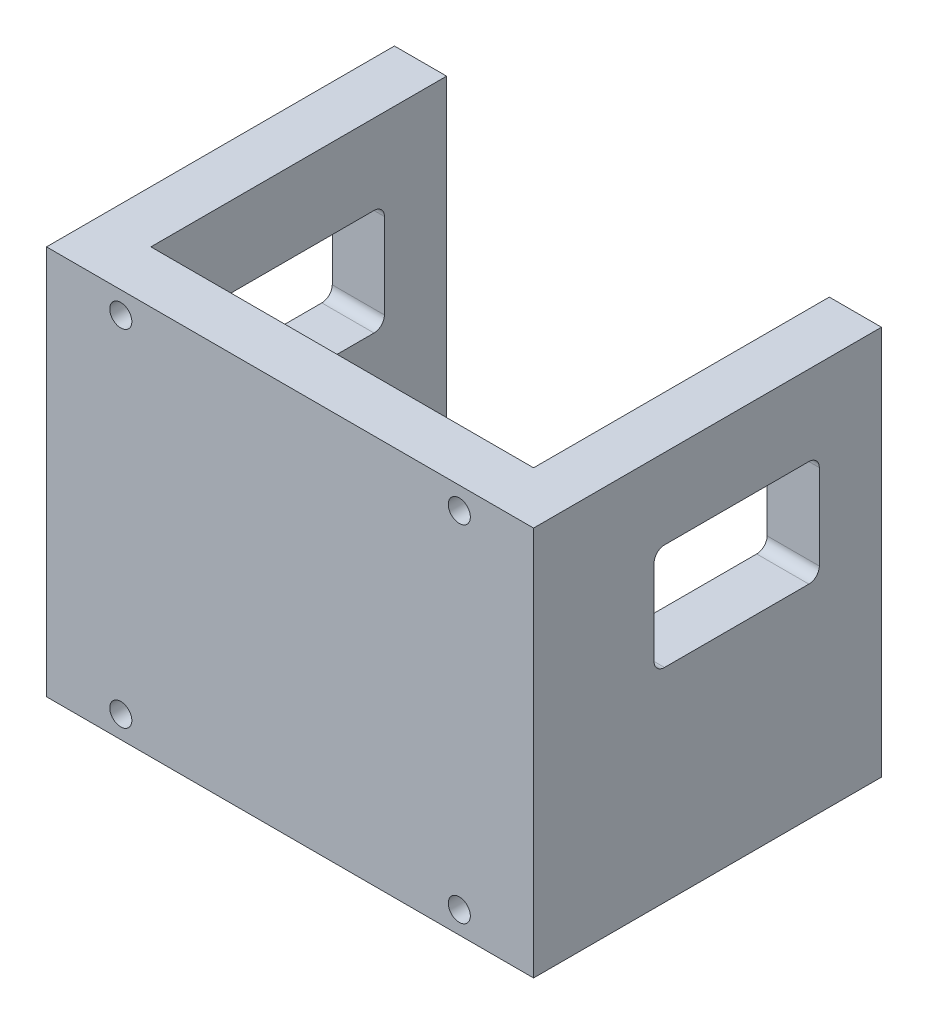
ISO-10303-21;
HEADER;
FILE_DESCRIPTION(('STEP AP214'),'2;1');
FILE_NAME('part.step','',(''),(''),'','','');
FILE_SCHEMA(('AUTOMOTIVE_DESIGN { 1 0 10303 214 1 1 1 1 }'));
ENDSEC;
DATA;
#1=APPLICATION_CONTEXT('core data for automotive mechanical design processes');
#2=APPLICATION_PROTOCOL_DEFINITION('international standard','automotive_design',2000,#1);
#3=PRODUCT_CONTEXT('',#1,'mechanical');
#4=PRODUCT('Part','Part','',(#3));
#5=PRODUCT_RELATED_PRODUCT_CATEGORY('part','',(#4));
#6=PRODUCT_DEFINITION_FORMATION('','',#4);
#7=PRODUCT_DEFINITION_CONTEXT('part definition',#1,'design');
#8=PRODUCT_DEFINITION('design','',#6,#7);
#9=PRODUCT_DEFINITION_SHAPE('','',#8);
#10=(LENGTH_UNIT() NAMED_UNIT(*) SI_UNIT(.MILLI.,.METRE.));
#11=(NAMED_UNIT(*) PLANE_ANGLE_UNIT() SI_UNIT($,.RADIAN.));
#12=(NAMED_UNIT(*) SI_UNIT($,.STERADIAN.) SOLID_ANGLE_UNIT());
#13=UNCERTAINTY_MEASURE_WITH_UNIT(LENGTH_MEASURE(1.E-05),#10,'distance_accuracy_value','');
#14=(GEOMETRIC_REPRESENTATION_CONTEXT(3) GLOBAL_UNCERTAINTY_ASSIGNED_CONTEXT((#13)) GLOBAL_UNIT_ASSIGNED_CONTEXT((#10,
#11,#12)) REPRESENTATION_CONTEXT('',''));
#15=CARTESIAN_POINT('',(0.,0.,0.));
#16=DIRECTION('',(0.,0.,1.));
#17=DIRECTION('',(1.,0.,0.));
#18=AXIS2_PLACEMENT_3D('',#15,#16,#17);
#19=CARTESIAN_POINT('',(0.,0.,0.));
#20=DIRECTION('',(0.,0.,1.));
#21=DIRECTION('',(1.,0.,0.));
#22=AXIS2_PLACEMENT_3D('',#19,#20,#21);
#23=PLANE('',#22);
#24=DIRECTION('',(0.,1.,0.));
#25=VECTOR('',#24,1.);
#26=CARTESIAN_POINT('',(15.4703686201804,-107.586067687366,0.));
#27=LINE('',#26,#25);
#28=CARTESIAN_POINT('',(15.4703686201804,-107.586067687366,0.));
#29=VERTEX_POINT('',#28);
#30=CARTESIAN_POINT('',(15.4703686201804,4.41393231263375,0.));
#31=VERTEX_POINT('',#30);
#32=EDGE_CURVE('E248',#29,#31,#27,.T.);
#33=ORIENTED_EDGE('',*,*,#32,.T.);
#34=DIRECTION('',(-1.,0.,0.));
#35=VECTOR('',#34,1.);
#36=CARTESIAN_POINT('',(-109.52963137982,4.41393231263375,0.));
#37=LINE('',#36,#35);
#38=CARTESIAN_POINT('',(30.4703686201804,4.41393231263375,0.));
#39=VERTEX_POINT('',#38);
#40=EDGE_CURVE('E259',#39,#31,#37,.T.);
#41=ORIENTED_EDGE('',*,*,#40,.F.);
#42=DIRECTION('',(0.,1.,0.));
#43=VECTOR('',#42,1.);
#44=CARTESIAN_POINT('',(30.4703686201804,-107.586067687366,0.));
#45=LINE('',#44,#43);
#46=CARTESIAN_POINT('',(30.4703686201804,-107.586067687366,0.));
#47=VERTEX_POINT('',#46);
#48=EDGE_CURVE('E275',#47,#39,#45,.T.);
#49=ORIENTED_EDGE('',*,*,#48,.F.);
#50=DIRECTION('',(1.,0.,0.));
#51=VECTOR('',#50,1.);
#52=CARTESIAN_POINT('',(-109.52963137982,-107.586067687366,0.));
#53=LINE('',#52,#51);
#54=EDGE_CURVE('E272',#29,#47,#53,.T.);
#55=ORIENTED_EDGE('',*,*,#54,.F.);
#56=EDGE_LOOP('',(#33,#41,#49,#55));
#57=FACE_BOUND('',#56,.T.);
#58=ADVANCED_FACE('F39',(#57),#23,.F.);
#59=CARTESIAN_POINT('',(-109.52963137982,4.41393231263375,100.));
#60=DIRECTION('',(1.,0.,0.));
#61=DIRECTION('',(0.,1.,0.));
#62=AXIS2_PLACEMENT_3D('',#59,#60,#61);
#63=PLANE('',#62);
#64=DIRECTION('',(0.,0.,1.));
#65=VECTOR('',#64,1.);
#66=CARTESIAN_POINT('',(-109.52963137982,-49.098204430468,17.8675184167871));
#67=LINE('',#66,#65);
#68=CARTESIAN_POINT('',(-109.52963137982,-49.098204430468,20.8675184167871));
#69=VERTEX_POINT('',#68);
#70=CARTESIAN_POINT('',(-109.52963137982,-49.098204430468,62.3675184167871));
#71=VERTEX_POINT('',#70);
#72=EDGE_CURVE('E450',#69,#71,#67,.T.);
#73=ORIENTED_EDGE('',*,*,#72,.F.);
#74=CARTESIAN_POINT('',(-109.52963137982,-46.098204430468,20.8675184167871));
#75=DIRECTION('',(1.,0.,0.));
#76=DIRECTION('',(0.,1.,0.));
#77=AXIS2_PLACEMENT_3D('',#74,#75,#76);
#78=CIRCLE('',#77,3.);
#79=CARTESIAN_POINT('',(-109.52963137982,-46.098204430468,17.8675184167871));
#80=VERTEX_POINT('',#79);
#81=EDGE_CURVE('E378',#69,#80,#78,.T.);
#82=ORIENTED_EDGE('',*,*,#81,.T.);
#83=DIRECTION('',(0.,-1.,0.));
#84=VECTOR('',#83,1.);
#85=CARTESIAN_POINT('',(-109.52963137982,-49.098204430468,17.8675184167871));
#86=LINE('',#85,#84);
#87=CARTESIAN_POINT('',(-109.52963137982,-21.598204430468,17.8675184167871));
#88=VERTEX_POINT('',#87);
#89=EDGE_CURVE('E446',#88,#80,#86,.T.);
#90=ORIENTED_EDGE('',*,*,#89,.F.);
#91=CARTESIAN_POINT('',(-109.52963137982,-21.598204430468,20.8675184167871));
#92=DIRECTION('',(1.,0.,0.));
#93=DIRECTION('',(0.,1.,0.));
#94=AXIS2_PLACEMENT_3D('',#91,#92,#93);
#95=CIRCLE('',#94,3.);
#96=CARTESIAN_POINT('',(-109.52963137982,-18.598204430468,20.8675184167871));
#97=VERTEX_POINT('',#96);
#98=EDGE_CURVE('E372',#88,#97,#95,.T.);
#99=ORIENTED_EDGE('',*,*,#98,.T.);
#100=DIRECTION('',(0.,0.,-1.));
#101=VECTOR('',#100,1.);
#102=CARTESIAN_POINT('',(-109.52963137982,-18.598204430468,17.8675184167871));
#103=LINE('',#102,#101);
#104=CARTESIAN_POINT('',(-109.52963137982,-18.598204430468,62.3675184167871));
#105=VERTEX_POINT('',#104);
#106=EDGE_CURVE('E425',#105,#97,#103,.T.);
#107=ORIENTED_EDGE('',*,*,#106,.F.);
#108=CARTESIAN_POINT('',(-109.52963137982,-21.598204430468,62.3675184167871));
#109=DIRECTION('',(1.,0.,0.));
#110=DIRECTION('',(0.,1.,0.));
#111=AXIS2_PLACEMENT_3D('',#108,#109,#110);
#112=CIRCLE('',#111,3.);
#113=CARTESIAN_POINT('',(-109.52963137982,-21.598204430468,65.3675184167871));
#114=VERTEX_POINT('',#113);
#115=EDGE_CURVE('E366',#105,#114,#112,.T.);
#116=ORIENTED_EDGE('',*,*,#115,.T.);
#117=DIRECTION('',(0.,1.,0.));
#118=VECTOR('',#117,1.);
#119=CARTESIAN_POINT('',(-109.52963137982,-49.098204430468,65.3675184167871));
#120=LINE('',#119,#118);
#121=CARTESIAN_POINT('',(-109.52963137982,-46.098204430468,65.3675184167871));
#122=VERTEX_POINT('',#121);
#123=EDGE_CURVE('E433',#122,#114,#120,.T.);
#124=ORIENTED_EDGE('',*,*,#123,.F.);
#125=CARTESIAN_POINT('',(-109.52963137982,-46.098204430468,62.3675184167871));
#126=DIRECTION('',(1.,0.,0.));
#127=DIRECTION('',(0.,1.,0.));
#128=AXIS2_PLACEMENT_3D('',#125,#126,#127);
#129=CIRCLE('',#128,3.);
#130=EDGE_CURVE('E384',#122,#71,#129,.T.);
#131=ORIENTED_EDGE('',*,*,#130,.T.);
#132=EDGE_LOOP('',(#73,#82,#90,#99,#107,#116,#124,#131));
#133=FACE_BOUND('',#132,.T.);
#134=DIRECTION('',(0.,-1.,0.));
#135=VECTOR('',#134,1.);
#136=CARTESIAN_POINT('',(-109.52963137982,4.41393231263375,0.));
#137=LINE('',#136,#135);
#138=CARTESIAN_POINT('',(-109.52963137982,4.41393231263375,0.));
#139=VERTEX_POINT('',#138);
#140=CARTESIAN_POINT('',(-109.52963137982,-107.586067687366,0.));
#141=VERTEX_POINT('',#140);
#142=EDGE_CURVE('E247',#139,#141,#137,.T.);
#143=ORIENTED_EDGE('',*,*,#142,.T.);
#144=DIRECTION('',(0.,0.,-1.));
#145=VECTOR('',#144,1.);
#146=CARTESIAN_POINT('',(-109.52963137982,-107.586067687366,100.));
#147=LINE('',#146,#145);
#148=CARTESIAN_POINT('',(-109.52963137982,-107.586067687366,100.));
#149=VERTEX_POINT('',#148);
#150=EDGE_CURVE('E293',#149,#141,#147,.T.);
#151=ORIENTED_EDGE('',*,*,#150,.F.);
#152=DIRECTION('',(0.,-1.,0.));
#153=VECTOR('',#152,1.);
#154=CARTESIAN_POINT('',(-109.52963137982,4.41393231263375,100.));
#155=LINE('',#154,#153);
#156=CARTESIAN_POINT('',(-109.52963137982,4.41393231263375,100.));
#157=VERTEX_POINT('',#156);
#158=EDGE_CURVE('E254',#157,#149,#155,.T.);
#159=ORIENTED_EDGE('',*,*,#158,.F.);
#160=DIRECTION('',(0.,0.,-1.));
#161=VECTOR('',#160,1.);
#162=CARTESIAN_POINT('',(-109.52963137982,4.41393231263375,100.));
#163=LINE('',#162,#161);
#164=EDGE_CURVE('E268',#157,#139,#163,.T.);
#165=ORIENTED_EDGE('',*,*,#164,.T.);
#166=EDGE_LOOP('',(#143,#151,#159,#165));
#167=FACE_BOUND('',#166,.T.);
#168=ADVANCED_FACE('F486',(#133,#167),#63,.F.);
#169=CARTESIAN_POINT('',(-109.52963137982,-107.586067687366,100.));
#170=DIRECTION('',(0.,1.,0.));
#171=DIRECTION('',(0.,0.,1.));
#172=AXIS2_PLACEMENT_3D('',#169,#170,#171);
#173=PLANE('',#172);
#174=CARTESIAN_POINT('',(-94.5296313798196,-107.586067687366,0.));
#175=VERTEX_POINT('',#174);
#176=EDGE_CURVE('E226',#141,#175,#53,.T.);
#177=ORIENTED_EDGE('',*,*,#176,.T.);
#178=DIRECTION('',(0.,0.,1.));
#179=VECTOR('',#178,1.);
#180=CARTESIAN_POINT('',(-94.5296313798196,-107.586067687366,0.));
#181=LINE('',#180,#179);
#182=CARTESIAN_POINT('',(-94.5296313798196,-107.586067687366,85.));
#183=VERTEX_POINT('',#182);
#184=EDGE_CURVE('E204',#175,#183,#181,.T.);
#185=ORIENTED_EDGE('',*,*,#184,.T.);
#186=DIRECTION('',(1.,0.,0.));
#187=VECTOR('',#186,1.);
#188=CARTESIAN_POINT('',(-94.5296313798196,-107.586067687366,85.));
#189=LINE('',#188,#187);
#190=CARTESIAN_POINT('',(15.4703686201804,-107.586067687366,85.));
#191=VERTEX_POINT('',#190);
#192=EDGE_CURVE('E217',#183,#191,#189,.T.);
#193=ORIENTED_EDGE('',*,*,#192,.T.);
#194=DIRECTION('',(0.,0.,1.));
#195=VECTOR('',#194,1.);
#196=CARTESIAN_POINT('',(15.4703686201804,-107.586067687366,0.));
#197=LINE('',#196,#195);
#198=EDGE_CURVE('E213',#29,#191,#197,.T.);
#199=ORIENTED_EDGE('',*,*,#198,.F.);
#200=ORIENTED_EDGE('',*,*,#54,.T.);
#201=DIRECTION('',(0.,0.,-1.));
#202=VECTOR('',#201,1.);
#203=CARTESIAN_POINT('',(30.4703686201804,-107.586067687366,100.));
#204=LINE('',#203,#202);
#205=CARTESIAN_POINT('',(30.4703686201804,-107.586067687366,100.));
#206=VERTEX_POINT('',#205);
#207=EDGE_CURVE('E289',#206,#47,#204,.T.);
#208=ORIENTED_EDGE('',*,*,#207,.F.);
#209=DIRECTION('',(1.,0.,0.));
#210=VECTOR('',#209,1.);
#211=CARTESIAN_POINT('',(-109.52963137982,-107.586067687366,100.));
#212=LINE('',#211,#210);
#213=EDGE_CURVE('E258',#149,#206,#212,.T.);
#214=ORIENTED_EDGE('',*,*,#213,.F.);
#215=ORIENTED_EDGE('',*,*,#150,.T.);
#216=EDGE_LOOP('',(#177,#185,#193,#199,#200,#208,#214,#215));
#217=FACE_BOUND('',#216,.T.);
#218=ADVANCED_FACE('F224',(#217),#173,.F.);
#219=CARTESIAN_POINT('',(30.4703686201804,-107.586067687366,100.));
#220=DIRECTION('',(-1.,0.,0.));
#221=DIRECTION('',(0.,0.,1.));
#222=AXIS2_PLACEMENT_3D('',#219,#220,#221);
#223=PLANE('',#222);
#224=DIRECTION('',(0.,1.,0.));
#225=VECTOR('',#224,1.);
#226=CARTESIAN_POINT('',(30.4703686201804,-49.098204430468,65.3675184167871));
#227=LINE('',#226,#225);
#228=CARTESIAN_POINT('',(30.4703686201804,-46.098204430468,65.3675184167871));
#229=VERTEX_POINT('',#228);
#230=CARTESIAN_POINT('',(30.4703686201804,-21.598204430468,65.3675184167871));
#231=VERTEX_POINT('',#230);
#232=EDGE_CURVE('E430',#229,#231,#227,.T.);
#233=ORIENTED_EDGE('',*,*,#232,.T.);
#234=CARTESIAN_POINT('',(30.4703686201804,-21.598204430468,62.3675184167871));
#235=DIRECTION('',(-1.,0.,0.));
#236=DIRECTION('',(0.,0.,1.));
#237=AXIS2_PLACEMENT_3D('',#234,#235,#236);
#238=CIRCLE('',#237,3.);
#239=CARTESIAN_POINT('',(30.4703686201804,-18.598204430468,62.3675184167871));
#240=VERTEX_POINT('',#239);
#241=EDGE_CURVE('E399',#231,#240,#238,.T.);
#242=ORIENTED_EDGE('',*,*,#241,.T.);
#243=DIRECTION('',(0.,0.,-1.));
#244=VECTOR('',#243,1.);
#245=CARTESIAN_POINT('',(30.4703686201804,-18.598204430468,17.8675184167871));
#246=LINE('',#245,#244);
#247=CARTESIAN_POINT('',(30.4703686201804,-18.598204430468,20.8675184167871));
#248=VERTEX_POINT('',#247);
#249=EDGE_CURVE('E442',#240,#248,#246,.T.);
#250=ORIENTED_EDGE('',*,*,#249,.T.);
#251=CARTESIAN_POINT('',(30.4703686201804,-21.598204430468,20.8675184167871));
#252=DIRECTION('',(-1.,0.,0.));
#253=DIRECTION('',(0.,0.,1.));
#254=AXIS2_PLACEMENT_3D('',#251,#252,#253);
#255=CIRCLE('',#254,3.);
#256=CARTESIAN_POINT('',(30.4703686201804,-21.598204430468,17.8675184167871));
#257=VERTEX_POINT('',#256);
#258=EDGE_CURVE('E11',#248,#257,#255,.T.);
#259=ORIENTED_EDGE('',*,*,#258,.T.);
#260=DIRECTION('',(0.,-1.,0.));
#261=VECTOR('',#260,1.);
#262=CARTESIAN_POINT('',(30.4703686201804,-49.098204430468,17.8675184167871));
#263=LINE('',#262,#261);
#264=CARTESIAN_POINT('',(30.4703686201804,-46.098204430468,17.8675184167871));
#265=VERTEX_POINT('',#264);
#266=EDGE_CURVE('E421',#257,#265,#263,.T.);
#267=ORIENTED_EDGE('',*,*,#266,.T.);
#268=CARTESIAN_POINT('',(30.4703686201804,-46.098204430468,20.8675184167871));
#269=DIRECTION('',(-1.,0.,0.));
#270=DIRECTION('',(0.,0.,1.));
#271=AXIS2_PLACEMENT_3D('',#268,#269,#270);
#272=CIRCLE('',#271,3.);
#273=CARTESIAN_POINT('',(30.4703686201804,-49.098204430468,20.8675184167871));
#274=VERTEX_POINT('',#273);
#275=EDGE_CURVE('E405',#265,#274,#272,.T.);
#276=ORIENTED_EDGE('',*,*,#275,.T.);
#277=DIRECTION('',(0.,0.,1.));
#278=VECTOR('',#277,1.);
#279=CARTESIAN_POINT('',(30.4703686201804,-49.098204430468,17.8675184167871));
#280=LINE('',#279,#278);
#281=CARTESIAN_POINT('',(30.4703686201804,-49.098204430468,62.3675184167871));
#282=VERTEX_POINT('',#281);
#283=EDGE_CURVE('E424',#274,#282,#280,.T.);
#284=ORIENTED_EDGE('',*,*,#283,.T.);
#285=CARTESIAN_POINT('',(30.4703686201804,-46.098204430468,62.3675184167871));
#286=DIRECTION('',(-1.,0.,0.));
#287=DIRECTION('',(0.,0.,1.));
#288=AXIS2_PLACEMENT_3D('',#285,#286,#287);
#289=CIRCLE('',#288,3.);
#290=EDGE_CURVE('E393',#282,#229,#289,.T.);
#291=ORIENTED_EDGE('',*,*,#290,.T.);
#292=EDGE_LOOP('',(#233,#242,#250,#259,#267,#276,#284,#291));
#293=FACE_BOUND('',#292,.T.);
#294=ORIENTED_EDGE('',*,*,#48,.T.);
#295=DIRECTION('',(0.,0.,-1.));
#296=VECTOR('',#295,1.);
#297=CARTESIAN_POINT('',(30.4703686201804,4.41393231263375,100.));
#298=LINE('',#297,#296);
#299=CARTESIAN_POINT('',(30.4703686201804,4.41393231263375,100.));
#300=VERTEX_POINT('',#299);
#301=EDGE_CURVE('E285',#300,#39,#298,.T.);
#302=ORIENTED_EDGE('',*,*,#301,.F.);
#303=DIRECTION('',(0.,1.,0.));
#304=VECTOR('',#303,1.);
#305=CARTESIAN_POINT('',(30.4703686201804,-107.586067687366,100.));
#306=LINE('',#305,#304);
#307=EDGE_CURVE('E262',#206,#300,#306,.T.);
#308=ORIENTED_EDGE('',*,*,#307,.F.);
#309=ORIENTED_EDGE('',*,*,#207,.T.);
#310=EDGE_LOOP('',(#294,#302,#308,#309));
#311=FACE_BOUND('',#310,.T.);
#312=ADVANCED_FACE('F549',(#293,#311),#223,.F.);
#313=CARTESIAN_POINT('',(-109.52963137982,4.41393231263375,100.));
#314=DIRECTION('',(0.,-1.,0.));
#315=DIRECTION('',(0.,0.,-1.));
#316=AXIS2_PLACEMENT_3D('',#313,#314,#315);
#317=PLANE('',#316);
#318=DIRECTION('',(1.,0.,0.));
#319=VECTOR('',#318,1.);
#320=CARTESIAN_POINT('',(-94.5296313798196,4.41393231263375,85.));
#321=LINE('',#320,#319);
#322=CARTESIAN_POINT('',(-94.5296313798196,4.41393231263375,85.));
#323=VERTEX_POINT('',#322);
#324=CARTESIAN_POINT('',(15.4703686201804,4.41393231263375,85.));
#325=VERTEX_POINT('',#324);
#326=EDGE_CURVE('E232',#323,#325,#321,.T.);
#327=ORIENTED_EDGE('',*,*,#326,.F.);
#328=DIRECTION('',(0.,0.,1.));
#329=VECTOR('',#328,1.);
#330=CARTESIAN_POINT('',(-94.5296313798196,4.41393231263375,0.));
#331=LINE('',#330,#329);
#332=CARTESIAN_POINT('',(-94.5296313798196,4.41393231263375,0.));
#333=VERTEX_POINT('',#332);
#334=EDGE_CURVE('E207',#333,#323,#331,.T.);
#335=ORIENTED_EDGE('',*,*,#334,.F.);
#336=EDGE_CURVE('E278',#333,#139,#37,.T.);
#337=ORIENTED_EDGE('',*,*,#336,.T.);
#338=ORIENTED_EDGE('',*,*,#164,.F.);
#339=DIRECTION('',(-1.,0.,0.));
#340=VECTOR('',#339,1.);
#341=CARTESIAN_POINT('',(-109.52963137982,4.41393231263375,100.));
#342=LINE('',#341,#340);
#343=EDGE_CURVE('E265',#300,#157,#342,.T.);
#344=ORIENTED_EDGE('',*,*,#343,.F.);
#345=ORIENTED_EDGE('',*,*,#301,.T.);
#346=ORIENTED_EDGE('',*,*,#40,.T.);
#347=DIRECTION('',(0.,0.,1.));
#348=VECTOR('',#347,1.);
#349=CARTESIAN_POINT('',(15.4703686201804,4.41393231263375,0.));
#350=LINE('',#349,#348);
#351=EDGE_CURVE('E228',#31,#325,#350,.T.);
#352=ORIENTED_EDGE('',*,*,#351,.T.);
#353=EDGE_LOOP('',(#327,#335,#337,#338,#344,#345,#346,#352));
#354=FACE_BOUND('',#353,.T.);
#355=ADVANCED_FACE('F536',(#354),#317,.F.);
#356=CARTESIAN_POINT('',(0.,0.,100.));
#357=DIRECTION('',(0.,0.,1.));
#358=DIRECTION('',(1.,0.,0.));
#359=AXIS2_PLACEMENT_3D('',#356,#357,#358);
#360=PLANE('',#359);
#361=CARTESIAN_POINT('',(-88.1796313798196,-101.236067687366,100.));
#362=DIRECTION('',(0.,0.,-1.));
#363=DIRECTION('',(1.,0.,0.));
#364=AXIS2_PLACEMENT_3D('',#361,#362,#363);
#365=CIRCLE('',#364,3.175);
#366=CARTESIAN_POINT('',(-85.0046313798196,-101.236067687366,100.));
#367=VERTEX_POINT('',#366);
#368=EDGE_CURVE('E598',#367,#367,#365,.T.);
#369=ORIENTED_EDGE('',*,*,#368,.T.);
#370=EDGE_LOOP('',(#369));
#371=FACE_BOUND('',#370,.T.);
#372=CARTESIAN_POINT('',(9.12036862018041,-101.236067687366,100.));
#373=DIRECTION('',(0.,0.,1.));
#374=DIRECTION('',(-1.,0.,0.));
#375=AXIS2_PLACEMENT_3D('',#372,#373,#374);
#376=CIRCLE('',#375,3.175);
#377=CARTESIAN_POINT('',(5.94536862018041,-101.236067687366,100.));
#378=VERTEX_POINT('',#377);
#379=EDGE_CURVE('E593',#378,#378,#376,.T.);
#380=ORIENTED_EDGE('',*,*,#379,.F.);
#381=EDGE_LOOP('',(#380));
#382=FACE_BOUND('',#381,.T.);
#383=CARTESIAN_POINT('',(-88.1796313798196,-1.93606768736623,100.));
#384=DIRECTION('',(0.,0.,1.));
#385=DIRECTION('',(1.,0.,0.));
#386=AXIS2_PLACEMENT_3D('',#383,#384,#385);
#387=CIRCLE('',#386,3.175);
#388=CARTESIAN_POINT('',(-85.0046313798196,-1.93606768736623,100.));
#389=VERTEX_POINT('',#388);
#390=EDGE_CURVE('E584',#389,#389,#387,.T.);
#391=ORIENTED_EDGE('',*,*,#390,.F.);
#392=EDGE_LOOP('',(#391));
#393=FACE_BOUND('',#392,.T.);
#394=CARTESIAN_POINT('',(9.12036862018041,-1.93606768736625,100.));
#395=DIRECTION('',(0.,0.,-1.));
#396=DIRECTION('',(-1.,0.,0.));
#397=AXIS2_PLACEMENT_3D('',#394,#395,#396);
#398=CIRCLE('',#397,3.175);
#399=CARTESIAN_POINT('',(5.94536862018041,-1.93606768736625,100.));
#400=VERTEX_POINT('',#399);
#401=EDGE_CURVE('E451',#400,#400,#398,.T.);
#402=ORIENTED_EDGE('',*,*,#401,.T.);
#403=EDGE_LOOP('',(#402));
#404=FACE_BOUND('',#403,.T.);
#405=ORIENTED_EDGE('',*,*,#158,.T.);
#406=ORIENTED_EDGE('',*,*,#213,.T.);
#407=ORIENTED_EDGE('',*,*,#307,.T.);
#408=ORIENTED_EDGE('',*,*,#343,.T.);
#409=EDGE_LOOP('',(#405,#406,#407,#408));
#410=FACE_BOUND('',#409,.T.);
#411=ADVANCED_FACE('F529',(#371,#382,#393,#404,#410),#360,.T.);
#412=ORIENTED_EDGE('',*,*,#336,.F.);
#413=DIRECTION('',(0.,1.,0.));
#414=VECTOR('',#413,1.);
#415=CARTESIAN_POINT('',(-94.5296313798196,-107.586067687366,0.));
#416=LINE('',#415,#414);
#417=EDGE_CURVE('E244',#175,#333,#416,.T.);
#418=ORIENTED_EDGE('',*,*,#417,.F.);
#419=ORIENTED_EDGE('',*,*,#176,.F.);
#420=ORIENTED_EDGE('',*,*,#142,.F.);
#421=EDGE_LOOP('',(#412,#418,#419,#420));
#422=FACE_BOUND('',#421,.T.);
#423=ADVANCED_FACE('F521',(#422),#23,.F.);
#424=CARTESIAN_POINT('',(-94.5296313798196,-107.586067687366,0.));
#425=DIRECTION('',(-1.,0.,0.));
#426=DIRECTION('',(0.,0.,1.));
#427=AXIS2_PLACEMENT_3D('',#424,#425,#426);
#428=PLANE('',#427);
#429=DIRECTION('',(0.,1.,0.));
#430=VECTOR('',#429,1.);
#431=CARTESIAN_POINT('',(-94.5296313798196,-107.586067687366,65.3675184167871));
#432=LINE('',#431,#430);
#433=CARTESIAN_POINT('',(-94.5296313798196,-46.098204430468,65.3675184167871));
#434=VERTEX_POINT('',#433);
#435=CARTESIAN_POINT('',(-94.5296313798196,-21.598204430468,65.3675184167871));
#436=VERTEX_POINT('',#435);
#437=EDGE_CURVE('E461',#434,#436,#432,.T.);
#438=ORIENTED_EDGE('',*,*,#437,.T.);
#439=CARTESIAN_POINT('',(-94.5296313798196,-21.598204430468,62.3675184167871));
#440=DIRECTION('',(-1.,0.,0.));
#441=DIRECTION('',(0.,0.,1.));
#442=AXIS2_PLACEMENT_3D('',#439,#440,#441);
#443=CIRCLE('',#442,3.);
#444=CARTESIAN_POINT('',(-94.5296313798196,-18.598204430468,62.3675184167871));
#445=VERTEX_POINT('',#444);
#446=EDGE_CURVE('E369',#436,#445,#443,.T.);
#447=ORIENTED_EDGE('',*,*,#446,.T.);
#448=DIRECTION('',(0.,0.,-1.));
#449=VECTOR('',#448,1.);
#450=CARTESIAN_POINT('',(-94.5296313798196,-18.598204430468,0.));
#451=LINE('',#450,#449);
#452=CARTESIAN_POINT('',(-94.5296313798196,-18.598204430468,20.8675184167871));
#453=VERTEX_POINT('',#452);
#454=EDGE_CURVE('E464',#445,#453,#451,.T.);
#455=ORIENTED_EDGE('',*,*,#454,.T.);
#456=CARTESIAN_POINT('',(-94.5296313798196,-21.598204430468,20.8675184167871));
#457=DIRECTION('',(-1.,0.,0.));
#458=DIRECTION('',(0.,0.,1.));
#459=AXIS2_PLACEMENT_3D('',#456,#457,#458);
#460=CIRCLE('',#459,3.);
#461=CARTESIAN_POINT('',(-94.5296313798196,-21.598204430468,17.8675184167871));
#462=VERTEX_POINT('',#461);
#463=EDGE_CURVE('E375',#453,#462,#460,.T.);
#464=ORIENTED_EDGE('',*,*,#463,.T.);
#465=DIRECTION('',(0.,-1.,0.));
#466=VECTOR('',#465,1.);
#467=CARTESIAN_POINT('',(-94.5296313798196,-107.586067687366,17.8675184167871));
#468=LINE('',#467,#466);
#469=CARTESIAN_POINT('',(-94.5296313798196,-46.098204430468,17.8675184167871));
#470=VERTEX_POINT('',#469);
#471=EDGE_CURVE('E235',#462,#470,#468,.T.);
#472=ORIENTED_EDGE('',*,*,#471,.T.);
#473=CARTESIAN_POINT('',(-94.5296313798196,-46.098204430468,20.8675184167871));
#474=DIRECTION('',(-1.,0.,0.));
#475=DIRECTION('',(0.,0.,1.));
#476=AXIS2_PLACEMENT_3D('',#473,#474,#475);
#477=CIRCLE('',#476,3.);
#478=CARTESIAN_POINT('',(-94.5296313798196,-49.098204430468,20.8675184167871));
#479=VERTEX_POINT('',#478);
#480=EDGE_CURVE('E381',#470,#479,#477,.T.);
#481=ORIENTED_EDGE('',*,*,#480,.T.);
#482=DIRECTION('',(0.,0.,1.));
#483=VECTOR('',#482,1.);
#484=CARTESIAN_POINT('',(-94.5296313798196,-49.098204430468,0.));
#485=LINE('',#484,#483);
#486=CARTESIAN_POINT('',(-94.5296313798196,-49.098204430468,62.3675184167871));
#487=VERTEX_POINT('',#486);
#488=EDGE_CURVE('E445',#479,#487,#485,.T.);
#489=ORIENTED_EDGE('',*,*,#488,.T.);
#490=CARTESIAN_POINT('',(-94.5296313798196,-46.098204430468,62.3675184167871));
#491=DIRECTION('',(-1.,0.,0.));
#492=DIRECTION('',(0.,0.,1.));
#493=AXIS2_PLACEMENT_3D('',#490,#491,#492);
#494=CIRCLE('',#493,3.);
#495=EDGE_CURVE('E387',#487,#434,#494,.T.);
#496=ORIENTED_EDGE('',*,*,#495,.T.);
#497=EDGE_LOOP('',(#438,#447,#455,#464,#472,#481,#489,#496));
#498=FACE_BOUND('',#497,.T.);
#499=ORIENTED_EDGE('',*,*,#334,.T.);
#500=DIRECTION('',(0.,1.,0.));
#501=VECTOR('',#500,1.);
#502=CARTESIAN_POINT('',(-94.5296313798196,-107.586067687366,85.));
#503=LINE('',#502,#501);
#504=EDGE_CURVE('E200',#183,#323,#503,.T.);
#505=ORIENTED_EDGE('',*,*,#504,.F.);
#506=ORIENTED_EDGE('',*,*,#184,.F.);
#507=ORIENTED_EDGE('',*,*,#417,.T.);
#508=EDGE_LOOP('',(#499,#505,#506,#507));
#509=FACE_BOUND('',#508,.T.);
#510=ADVANCED_FACE('F202',(#498,#509),#428,.F.);
#511=CARTESIAN_POINT('',(15.4703686201804,-107.586067687366,0.));
#512=DIRECTION('',(-1.,0.,0.));
#513=DIRECTION('',(0.,0.,1.));
#514=AXIS2_PLACEMENT_3D('',#511,#512,#513);
#515=PLANE('',#514);
#516=DIRECTION('',(0.,-1.,0.));
#517=VECTOR('',#516,1.);
#518=CARTESIAN_POINT('',(15.4703686201804,-107.586067687366,17.8675184167871));
#519=LINE('',#518,#517);
#520=CARTESIAN_POINT('',(15.4703686201804,-21.598204430468,17.8675184167871));
#521=VERTEX_POINT('',#520);
#522=CARTESIAN_POINT('',(15.4703686201804,-46.098204430468,17.8675184167871));
#523=VERTEX_POINT('',#522);
#524=EDGE_CURVE('E308',#521,#523,#519,.T.);
#525=ORIENTED_EDGE('',*,*,#524,.F.);
#526=CARTESIAN_POINT('',(15.4703686201804,-21.598204430468,20.8675184167871));
#527=DIRECTION('',(-1.,0.,0.));
#528=DIRECTION('',(0.,0.,1.));
#529=AXIS2_PLACEMENT_3D('',#526,#527,#528);
#530=CIRCLE('',#529,3.);
#531=CARTESIAN_POINT('',(15.4703686201804,-18.598204430468,20.8675184167871));
#532=VERTEX_POINT('',#531);
#533=EDGE_CURVE('E48',#521,#532,#530,.F.);
#534=ORIENTED_EDGE('',*,*,#533,.T.);
#535=DIRECTION('',(0.,0.,-1.));
#536=VECTOR('',#535,1.);
#537=CARTESIAN_POINT('',(15.4703686201804,-18.598204430468,0.));
#538=LINE('',#537,#536);
#539=CARTESIAN_POINT('',(15.4703686201804,-18.598204430468,62.3675184167871));
#540=VERTEX_POINT('',#539);
#541=EDGE_CURVE('E304',#540,#532,#538,.T.);
#542=ORIENTED_EDGE('',*,*,#541,.F.);
#543=CARTESIAN_POINT('',(15.4703686201804,-21.598204430468,62.3675184167871));
#544=DIRECTION('',(-1.,0.,0.));
#545=DIRECTION('',(0.,0.,1.));
#546=AXIS2_PLACEMENT_3D('',#543,#544,#545);
#547=CIRCLE('',#546,3.);
#548=CARTESIAN_POINT('',(15.4703686201804,-21.598204430468,65.3675184167871));
#549=VERTEX_POINT('',#548);
#550=EDGE_CURVE('E396',#540,#549,#547,.F.);
#551=ORIENTED_EDGE('',*,*,#550,.T.);
#552=DIRECTION('',(0.,1.,0.));
#553=VECTOR('',#552,1.);
#554=CARTESIAN_POINT('',(15.4703686201804,-107.586067687366,65.3675184167871));
#555=LINE('',#554,#553);
#556=CARTESIAN_POINT('',(15.4703686201804,-46.098204430468,65.3675184167871));
#557=VERTEX_POINT('',#556);
#558=EDGE_CURVE('E300',#557,#549,#555,.T.);
#559=ORIENTED_EDGE('',*,*,#558,.F.);
#560=CARTESIAN_POINT('',(15.4703686201804,-46.098204430468,62.3675184167871));
#561=DIRECTION('',(-1.,0.,0.));
#562=DIRECTION('',(0.,0.,1.));
#563=AXIS2_PLACEMENT_3D('',#560,#561,#562);
#564=CIRCLE('',#563,3.);
#565=CARTESIAN_POINT('',(15.4703686201804,-49.098204430468,62.3675184167871));
#566=VERTEX_POINT('',#565);
#567=EDGE_CURVE('E390',#557,#566,#564,.F.);
#568=ORIENTED_EDGE('',*,*,#567,.T.);
#569=DIRECTION('',(0.,0.,1.));
#570=VECTOR('',#569,1.);
#571=CARTESIAN_POINT('',(15.4703686201804,-49.098204430468,0.));
#572=LINE('',#571,#570);
#573=CARTESIAN_POINT('',(15.4703686201804,-49.098204430468,20.8675184167871));
#574=VERTEX_POINT('',#573);
#575=EDGE_CURVE('E296',#574,#566,#572,.T.);
#576=ORIENTED_EDGE('',*,*,#575,.F.);
#577=CARTESIAN_POINT('',(15.4703686201804,-46.098204430468,20.8675184167871));
#578=DIRECTION('',(-1.,0.,0.));
#579=DIRECTION('',(0.,0.,1.));
#580=AXIS2_PLACEMENT_3D('',#577,#578,#579);
#581=CIRCLE('',#580,3.);
#582=EDGE_CURVE('E402',#574,#523,#581,.F.);
#583=ORIENTED_EDGE('',*,*,#582,.T.);
#584=EDGE_LOOP('',(#525,#534,#542,#551,#559,#568,#576,#583));
#585=FACE_BOUND('',#584,.T.);
#586=ORIENTED_EDGE('',*,*,#351,.F.);
#587=ORIENTED_EDGE('',*,*,#32,.F.);
#588=ORIENTED_EDGE('',*,*,#198,.T.);
#589=DIRECTION('',(0.,1.,0.));
#590=VECTOR('',#589,1.);
#591=CARTESIAN_POINT('',(15.4703686201804,-107.586067687366,85.));
#592=LINE('',#591,#590);
#593=EDGE_CURVE('E212',#191,#325,#592,.T.);
#594=ORIENTED_EDGE('',*,*,#593,.T.);
#595=EDGE_LOOP('',(#586,#587,#588,#594));
#596=FACE_BOUND('',#595,.T.);
#597=ADVANCED_FACE('F411',(#585,#596),#515,.T.);
#598=CARTESIAN_POINT('',(-94.5296313798196,-107.586067687366,85.));
#599=DIRECTION('',(0.,0.,1.));
#600=DIRECTION('',(1.,0.,0.));
#601=AXIS2_PLACEMENT_3D('',#598,#599,#600);
#602=PLANE('',#601);
#603=CARTESIAN_POINT('',(-88.1796313798196,-101.236067687366,85.));
#604=DIRECTION('',(0.,0.,-1.));
#605=DIRECTION('',(1.,0.,0.));
#606=AXIS2_PLACEMENT_3D('',#603,#604,#605);
#607=CIRCLE('',#606,3.175);
#608=CARTESIAN_POINT('',(-85.0046313798196,-101.236067687366,85.));
#609=VERTEX_POINT('',#608);
#610=EDGE_CURVE('E571',#609,#609,#607,.T.);
#611=ORIENTED_EDGE('',*,*,#610,.F.);
#612=EDGE_LOOP('',(#611));
#613=FACE_BOUND('',#612,.T.);
#614=CARTESIAN_POINT('',(9.12036862018041,-101.236067687366,85.));
#615=DIRECTION('',(0.,0.,1.));
#616=DIRECTION('',(-1.,0.,0.));
#617=AXIS2_PLACEMENT_3D('',#614,#615,#616);
#618=CIRCLE('',#617,3.175);
#619=CARTESIAN_POINT('',(5.94536862018041,-101.236067687366,85.));
#620=VERTEX_POINT('',#619);
#621=EDGE_CURVE('E575',#620,#620,#618,.T.);
#622=ORIENTED_EDGE('',*,*,#621,.T.);
#623=EDGE_LOOP('',(#622));
#624=FACE_BOUND('',#623,.T.);
#625=CARTESIAN_POINT('',(-88.1796313798196,-1.93606768736623,85.));
#626=DIRECTION('',(0.,0.,1.));
#627=DIRECTION('',(1.,0.,0.));
#628=AXIS2_PLACEMENT_3D('',#625,#626,#627);
#629=CIRCLE('',#628,3.175);
#630=CARTESIAN_POINT('',(-85.0046313798196,-1.93606768736623,85.));
#631=VERTEX_POINT('',#630);
#632=EDGE_CURVE('E579',#631,#631,#629,.T.);
#633=ORIENTED_EDGE('',*,*,#632,.T.);
#634=EDGE_LOOP('',(#633));
#635=FACE_BOUND('',#634,.T.);
#636=CARTESIAN_POINT('',(9.12036862018041,-1.93606768736625,85.));
#637=DIRECTION('',(0.,0.,-1.));
#638=DIRECTION('',(-1.,0.,0.));
#639=AXIS2_PLACEMENT_3D('',#636,#637,#638);
#640=CIRCLE('',#639,3.175);
#641=CARTESIAN_POINT('',(5.94536862018041,-1.93606768736625,85.));
#642=VERTEX_POINT('',#641);
#643=EDGE_CURVE('E436',#642,#642,#640,.T.);
#644=ORIENTED_EDGE('',*,*,#643,.F.);
#645=EDGE_LOOP('',(#644));
#646=FACE_BOUND('',#645,.T.);
#647=ORIENTED_EDGE('',*,*,#326,.T.);
#648=ORIENTED_EDGE('',*,*,#593,.F.);
#649=ORIENTED_EDGE('',*,*,#192,.F.);
#650=ORIENTED_EDGE('',*,*,#504,.T.);
#651=EDGE_LOOP('',(#647,#648,#649,#650));
#652=FACE_BOUND('',#651,.T.);
#653=ADVANCED_FACE('F218',(#613,#624,#635,#646,#652),#602,.F.);
#654=CARTESIAN_POINT('',(30.4703686201804,-49.098204430468,17.8675184167871));
#655=DIRECTION('',(0.,-1.,0.));
#656=DIRECTION('',(1.,0.,0.));
#657=AXIS2_PLACEMENT_3D('',#654,#655,#656);
#658=PLANE('',#657);
#659=ORIENTED_EDGE('',*,*,#575,.T.);
#660=DIRECTION('',(-1.,0.,0.));
#661=VECTOR('',#660,1.);
#662=CARTESIAN_POINT('',(30.4703686201804,-49.098204430468,62.3675184167871));
#663=LINE('',#662,#661);
#664=EDGE_CURVE('E350',#566,#282,#663,.F.);
#665=ORIENTED_EDGE('',*,*,#664,.T.);
#666=ORIENTED_EDGE('',*,*,#283,.F.);
#667=DIRECTION('',(-1.,0.,0.));
#668=VECTOR('',#667,1.);
#669=CARTESIAN_POINT('',(15.4703686201804,-49.098204430468,20.8675184167871));
#670=LINE('',#669,#668);
#671=EDGE_CURVE('E346',#274,#574,#670,.T.);
#672=ORIENTED_EDGE('',*,*,#671,.T.);
#673=EDGE_LOOP('',(#659,#665,#666,#672));
#674=FACE_BOUND('',#673,.T.);
#675=ADVANCED_FACE('F560',(#674),#658,.F.);
#676=CARTESIAN_POINT('',(30.4703686201804,-49.098204430468,65.3675184167871));
#677=DIRECTION('',(0.,0.,1.));
#678=DIRECTION('',(1.,0.,0.));
#679=AXIS2_PLACEMENT_3D('',#676,#677,#678);
#680=PLANE('',#679);
#681=ORIENTED_EDGE('',*,*,#232,.F.);
#682=DIRECTION('',(-1.,0.,0.));
#683=VECTOR('',#682,1.);
#684=CARTESIAN_POINT('',(15.4703686201804,-46.098204430468,65.3675184167871));
#685=LINE('',#684,#683);
#686=EDGE_CURVE('E342',#229,#557,#685,.T.);
#687=ORIENTED_EDGE('',*,*,#686,.T.);
#688=ORIENTED_EDGE('',*,*,#558,.T.);
#689=DIRECTION('',(-1.,0.,0.));
#690=VECTOR('',#689,1.);
#691=CARTESIAN_POINT('',(30.4703686201804,-21.598204430468,65.3675184167871));
#692=LINE('',#691,#690);
#693=EDGE_CURVE('E339',#549,#231,#692,.F.);
#694=ORIENTED_EDGE('',*,*,#693,.T.);
#695=EDGE_LOOP('',(#681,#687,#688,#694));
#696=FACE_BOUND('',#695,.T.);
#697=ADVANCED_FACE('F566',(#696),#680,.F.);
#698=CARTESIAN_POINT('',(30.4703686201804,-18.598204430468,17.8675184167871));
#699=DIRECTION('',(0.,1.,0.));
#700=DIRECTION('',(-1.,0.,0.));
#701=AXIS2_PLACEMENT_3D('',#698,#699,#700);
#702=PLANE('',#701);
#703=ORIENTED_EDGE('',*,*,#249,.F.);
#704=DIRECTION('',(-1.,0.,0.));
#705=VECTOR('',#704,1.);
#706=CARTESIAN_POINT('',(15.4703686201804,-18.598204430468,62.3675184167871));
#707=LINE('',#706,#705);
#708=EDGE_CURVE('E356',#240,#540,#707,.T.);
#709=ORIENTED_EDGE('',*,*,#708,.T.);
#710=ORIENTED_EDGE('',*,*,#541,.T.);
#711=DIRECTION('',(-1.,0.,0.));
#712=VECTOR('',#711,1.);
#713=CARTESIAN_POINT('',(30.4703686201804,-18.598204430468,20.8675184167871));
#714=LINE('',#713,#712);
#715=EDGE_CURVE('E353',#532,#248,#714,.F.);
#716=ORIENTED_EDGE('',*,*,#715,.T.);
#717=EDGE_LOOP('',(#703,#709,#710,#716));
#718=FACE_BOUND('',#717,.T.);
#719=ADVANCED_FACE('F418',(#718),#702,.F.);
#720=CARTESIAN_POINT('',(30.4703686201804,-49.098204430468,17.8675184167871));
#721=DIRECTION('',(0.,0.,-1.));
#722=DIRECTION('',(-1.,0.,0.));
#723=AXIS2_PLACEMENT_3D('',#720,#721,#722);
#724=PLANE('',#723);
#725=ORIENTED_EDGE('',*,*,#524,.T.);
#726=DIRECTION('',(-1.,0.,0.));
#727=VECTOR('',#726,1.);
#728=CARTESIAN_POINT('',(30.4703686201804,-46.098204430468,17.8675184167871));
#729=LINE('',#728,#727);
#730=EDGE_CURVE('E55',#523,#265,#729,.F.);
#731=ORIENTED_EDGE('',*,*,#730,.T.);
#732=ORIENTED_EDGE('',*,*,#266,.F.);
#733=DIRECTION('',(-1.,0.,0.));
#734=VECTOR('',#733,1.);
#735=CARTESIAN_POINT('',(15.4703686201804,-21.598204430468,17.8675184167871));
#736=LINE('',#735,#734);
#737=EDGE_CURVE('E360',#257,#521,#736,.T.);
#738=ORIENTED_EDGE('',*,*,#737,.T.);
#739=EDGE_LOOP('',(#725,#731,#732,#738));
#740=FACE_BOUND('',#739,.T.);
#741=ADVANCED_FACE('F420',(#740),#724,.F.);
#742=ORIENTED_EDGE('',*,*,#471,.F.);
#743=DIRECTION('',(-1.,0.,0.));
#744=VECTOR('',#743,1.);
#745=CARTESIAN_POINT('',(-109.52963137982,-21.598204430468,17.8675184167871));
#746=LINE('',#745,#744);
#747=EDGE_CURVE('E328',#462,#88,#746,.T.);
#748=ORIENTED_EDGE('',*,*,#747,.T.);
#749=ORIENTED_EDGE('',*,*,#89,.T.);
#750=DIRECTION('',(-1.,0.,0.));
#751=VECTOR('',#750,1.);
#752=CARTESIAN_POINT('',(-94.5296313798196,-46.098204430468,17.8675184167871));
#753=LINE('',#752,#751);
#754=EDGE_CURVE('E325',#80,#470,#753,.F.);
#755=ORIENTED_EDGE('',*,*,#754,.T.);
#756=EDGE_LOOP('',(#742,#748,#749,#755));
#757=FACE_BOUND('',#756,.T.);
#758=ADVANCED_FACE('F508',(#757),#724,.F.);
#759=ORIENTED_EDGE('',*,*,#454,.F.);
#760=DIRECTION('',(-1.,0.,0.));
#761=VECTOR('',#760,1.);
#762=CARTESIAN_POINT('',(-109.52963137982,-18.598204430468,62.3675184167871));
#763=LINE('',#762,#761);
#764=EDGE_CURVE('E314',#445,#105,#763,.T.);
#765=ORIENTED_EDGE('',*,*,#764,.T.);
#766=ORIENTED_EDGE('',*,*,#106,.T.);
#767=DIRECTION('',(-1.,0.,0.));
#768=VECTOR('',#767,1.);
#769=CARTESIAN_POINT('',(-94.5296313798196,-18.598204430468,20.8675184167871));
#770=LINE('',#769,#768);
#771=EDGE_CURVE('E311',#97,#453,#770,.F.);
#772=ORIENTED_EDGE('',*,*,#771,.T.);
#773=EDGE_LOOP('',(#759,#765,#766,#772));
#774=FACE_BOUND('',#773,.T.);
#775=ADVANCED_FACE('F504',(#774),#702,.F.);
#776=ORIENTED_EDGE('',*,*,#123,.T.);
#777=DIRECTION('',(-1.,0.,0.));
#778=VECTOR('',#777,1.);
#779=CARTESIAN_POINT('',(-94.5296313798196,-21.598204430468,65.3675184167871));
#780=LINE('',#779,#778);
#781=EDGE_CURVE('E322',#114,#436,#780,.F.);
#782=ORIENTED_EDGE('',*,*,#781,.T.);
#783=ORIENTED_EDGE('',*,*,#437,.F.);
#784=DIRECTION('',(-1.,0.,0.));
#785=VECTOR('',#784,1.);
#786=CARTESIAN_POINT('',(-109.52963137982,-46.098204430468,65.3675184167871));
#787=LINE('',#786,#785);
#788=EDGE_CURVE('E318',#434,#122,#787,.T.);
#789=ORIENTED_EDGE('',*,*,#788,.T.);
#790=EDGE_LOOP('',(#776,#782,#783,#789));
#791=FACE_BOUND('',#790,.T.);
#792=ADVANCED_FACE('F496',(#791),#680,.F.);
#793=ORIENTED_EDGE('',*,*,#488,.F.);
#794=DIRECTION('',(-1.,0.,0.));
#795=VECTOR('',#794,1.);
#796=CARTESIAN_POINT('',(-109.52963137982,-49.098204430468,20.8675184167871));
#797=LINE('',#796,#795);
#798=EDGE_CURVE('E335',#479,#69,#797,.T.);
#799=ORIENTED_EDGE('',*,*,#798,.T.);
#800=ORIENTED_EDGE('',*,*,#72,.T.);
#801=DIRECTION('',(-1.,0.,0.));
#802=VECTOR('',#801,1.);
#803=CARTESIAN_POINT('',(-94.5296313798196,-49.098204430468,62.3675184167871));
#804=LINE('',#803,#802);
#805=EDGE_CURVE('E332',#71,#487,#804,.F.);
#806=ORIENTED_EDGE('',*,*,#805,.T.);
#807=EDGE_LOOP('',(#793,#799,#800,#806));
#808=FACE_BOUND('',#807,.T.);
#809=ADVANCED_FACE('F483',(#808),#658,.F.);
#810=CARTESIAN_POINT('',(9.12036862018041,-1.93606768736625,100.));
#811=DIRECTION('',(0.,0.,-1.));
#812=DIRECTION('',(-1.,0.,0.));
#813=AXIS2_PLACEMENT_3D('',#810,#811,#812);
#814=CYLINDRICAL_SURFACE('',#813,3.175);
#815=ORIENTED_EDGE('',*,*,#401,.F.);
#816=EDGE_LOOP('',(#815));
#817=FACE_BOUND('',#816,.T.);
#818=ORIENTED_EDGE('',*,*,#643,.T.);
#819=EDGE_LOOP('',(#818));
#820=FACE_BOUND('',#819,.T.);
#821=ADVANCED_FACE('F625',(#817,#820),#814,.F.);
#822=CARTESIAN_POINT('',(-88.1796313798196,-1.93606768736623,100.));
#823=DIRECTION('',(0.,0.,-1.));
#824=DIRECTION('',(-1.,0.,0.));
#825=AXIS2_PLACEMENT_3D('',#822,#823,#824);
#826=CYLINDRICAL_SURFACE('',#825,3.175);
#827=ORIENTED_EDGE('',*,*,#390,.T.);
#828=EDGE_LOOP('',(#827));
#829=FACE_BOUND('',#828,.T.);
#830=ORIENTED_EDGE('',*,*,#632,.F.);
#831=EDGE_LOOP('',(#830));
#832=FACE_BOUND('',#831,.T.);
#833=ADVANCED_FACE('F619',(#829,#832),#826,.F.);
#834=CARTESIAN_POINT('',(9.12036862018041,-101.236067687366,100.));
#835=DIRECTION('',(0.,0.,-1.));
#836=DIRECTION('',(-1.,0.,0.));
#837=AXIS2_PLACEMENT_3D('',#834,#835,#836);
#838=CYLINDRICAL_SURFACE('',#837,3.175);
#839=ORIENTED_EDGE('',*,*,#379,.T.);
#840=EDGE_LOOP('',(#839));
#841=FACE_BOUND('',#840,.T.);
#842=ORIENTED_EDGE('',*,*,#621,.F.);
#843=EDGE_LOOP('',(#842));
#844=FACE_BOUND('',#843,.T.);
#845=ADVANCED_FACE('F612',(#841,#844),#838,.F.);
#846=CARTESIAN_POINT('',(-88.1796313798196,-101.236067687366,100.));
#847=DIRECTION('',(0.,0.,-1.));
#848=DIRECTION('',(-1.,0.,0.));
#849=AXIS2_PLACEMENT_3D('',#846,#847,#848);
#850=CYLINDRICAL_SURFACE('',#849,3.175);
#851=ORIENTED_EDGE('',*,*,#368,.F.);
#852=EDGE_LOOP('',(#851));
#853=FACE_BOUND('',#852,.T.);
#854=ORIENTED_EDGE('',*,*,#610,.T.);
#855=EDGE_LOOP('',(#854));
#856=FACE_BOUND('',#855,.T.);
#857=ADVANCED_FACE('F609',(#853,#856),#850,.F.);
#858=CARTESIAN_POINT('',(30.4703686201804,-21.598204430468,62.3675184167871));
#859=DIRECTION('',(1.,0.,0.));
#860=DIRECTION('',(0.,1.,0.));
#861=AXIS2_PLACEMENT_3D('',#858,#859,#860);
#862=CYLINDRICAL_SURFACE('',#861,3.);
#863=ORIENTED_EDGE('',*,*,#446,.F.);
#864=ORIENTED_EDGE('',*,*,#781,.F.);
#865=ORIENTED_EDGE('',*,*,#115,.F.);
#866=ORIENTED_EDGE('',*,*,#764,.F.);
#867=EDGE_LOOP('',(#863,#864,#865,#866));
#868=FACE_BOUND('',#867,.T.);
#869=ADVANCED_FACE('F501',(#868),#862,.F.);
#870=CARTESIAN_POINT('',(30.4703686201804,-21.598204430468,20.8675184167871));
#871=DIRECTION('',(1.,0.,0.));
#872=DIRECTION('',(0.,1.,0.));
#873=AXIS2_PLACEMENT_3D('',#870,#871,#872);
#874=CYLINDRICAL_SURFACE('',#873,3.);
#875=ORIENTED_EDGE('',*,*,#463,.F.);
#876=ORIENTED_EDGE('',*,*,#771,.F.);
#877=ORIENTED_EDGE('',*,*,#98,.F.);
#878=ORIENTED_EDGE('',*,*,#747,.F.);
#879=EDGE_LOOP('',(#875,#876,#877,#878));
#880=FACE_BOUND('',#879,.T.);
#881=ADVANCED_FACE('F507',(#880),#874,.F.);
#882=CARTESIAN_POINT('',(30.4703686201804,-46.098204430468,20.8675184167871));
#883=DIRECTION('',(1.,0.,0.));
#884=DIRECTION('',(0.,1.,0.));
#885=AXIS2_PLACEMENT_3D('',#882,#883,#884);
#886=CYLINDRICAL_SURFACE('',#885,3.);
#887=ORIENTED_EDGE('',*,*,#480,.F.);
#888=ORIENTED_EDGE('',*,*,#754,.F.);
#889=ORIENTED_EDGE('',*,*,#81,.F.);
#890=ORIENTED_EDGE('',*,*,#798,.F.);
#891=EDGE_LOOP('',(#887,#888,#889,#890));
#892=FACE_BOUND('',#891,.T.);
#893=ADVANCED_FACE('F480',(#892),#886,.F.);
#894=CARTESIAN_POINT('',(30.4703686201804,-46.098204430468,62.3675184167871));
#895=DIRECTION('',(1.,0.,0.));
#896=DIRECTION('',(0.,1.,0.));
#897=AXIS2_PLACEMENT_3D('',#894,#895,#896);
#898=CYLINDRICAL_SURFACE('',#897,3.);
#899=ORIENTED_EDGE('',*,*,#495,.F.);
#900=ORIENTED_EDGE('',*,*,#805,.F.);
#901=ORIENTED_EDGE('',*,*,#130,.F.);
#902=ORIENTED_EDGE('',*,*,#788,.F.);
#903=EDGE_LOOP('',(#899,#900,#901,#902));
#904=FACE_BOUND('',#903,.T.);
#905=ADVANCED_FACE('F493',(#904),#898,.F.);
#906=CARTESIAN_POINT('',(30.4703686201804,-46.098204430468,62.3675184167871));
#907=DIRECTION('',(1.,0.,0.));
#908=DIRECTION('',(0.,1.,0.));
#909=AXIS2_PLACEMENT_3D('',#906,#907,#908);
#910=CYLINDRICAL_SURFACE('',#909,3.);
#911=ORIENTED_EDGE('',*,*,#290,.F.);
#912=ORIENTED_EDGE('',*,*,#664,.F.);
#913=ORIENTED_EDGE('',*,*,#567,.F.);
#914=ORIENTED_EDGE('',*,*,#686,.F.);
#915=EDGE_LOOP('',(#911,#912,#913,#914));
#916=FACE_BOUND('',#915,.T.);
#917=ADVANCED_FACE('F768',(#916),#910,.F.);
#918=CARTESIAN_POINT('',(30.4703686201804,-21.598204430468,62.3675184167871));
#919=DIRECTION('',(1.,0.,0.));
#920=DIRECTION('',(0.,1.,0.));
#921=AXIS2_PLACEMENT_3D('',#918,#919,#920);
#922=CYLINDRICAL_SURFACE('',#921,3.);
#923=ORIENTED_EDGE('',*,*,#241,.F.);
#924=ORIENTED_EDGE('',*,*,#693,.F.);
#925=ORIENTED_EDGE('',*,*,#550,.F.);
#926=ORIENTED_EDGE('',*,*,#708,.F.);
#927=EDGE_LOOP('',(#923,#924,#925,#926));
#928=FACE_BOUND('',#927,.T.);
#929=ADVANCED_FACE('F771',(#928),#922,.F.);
#930=CARTESIAN_POINT('',(30.4703686201804,-46.098204430468,20.8675184167871));
#931=DIRECTION('',(1.,0.,0.));
#932=DIRECTION('',(0.,1.,0.));
#933=AXIS2_PLACEMENT_3D('',#930,#931,#932);
#934=CYLINDRICAL_SURFACE('',#933,3.);
#935=ORIENTED_EDGE('',*,*,#275,.F.);
#936=ORIENTED_EDGE('',*,*,#730,.F.);
#937=ORIENTED_EDGE('',*,*,#582,.F.);
#938=ORIENTED_EDGE('',*,*,#671,.F.);
#939=EDGE_LOOP('',(#935,#936,#937,#938));
#940=FACE_BOUND('',#939,.T.);
#941=ADVANCED_FACE('F774',(#940),#934,.F.);
#942=CARTESIAN_POINT('',(30.4703686201804,-21.598204430468,20.8675184167871));
#943=DIRECTION('',(1.,0.,0.));
#944=DIRECTION('',(0.,1.,0.));
#945=AXIS2_PLACEMENT_3D('',#942,#943,#944);
#946=CYLINDRICAL_SURFACE('',#945,3.);
#947=ORIENTED_EDGE('',*,*,#258,.F.);
#948=ORIENTED_EDGE('',*,*,#715,.F.);
#949=ORIENTED_EDGE('',*,*,#533,.F.);
#950=ORIENTED_EDGE('',*,*,#737,.F.);
#951=EDGE_LOOP('',(#947,#948,#949,#950));
#952=FACE_BOUND('',#951,.T.);
#953=ADVANCED_FACE('F41',(#952),#946,.F.);
#954=CLOSED_SHELL('',(#58,#168,#218,#312,#355,#411,#423,#510,#597,#653,#675,#697,#719,#741,#758,
#775,#792,#809,#821,#833,#845,#857,#869,#881,#893,#905,#917,#929,#941,#953));
#955=MANIFOLD_SOLID_BREP('B2',#954);
#956=ADVANCED_BREP_SHAPE_REPRESENTATION('',(#18,#955),#14);
#957=SHAPE_DEFINITION_REPRESENTATION(#9,#956);
ENDSEC;
END-ISO-10303-21;
